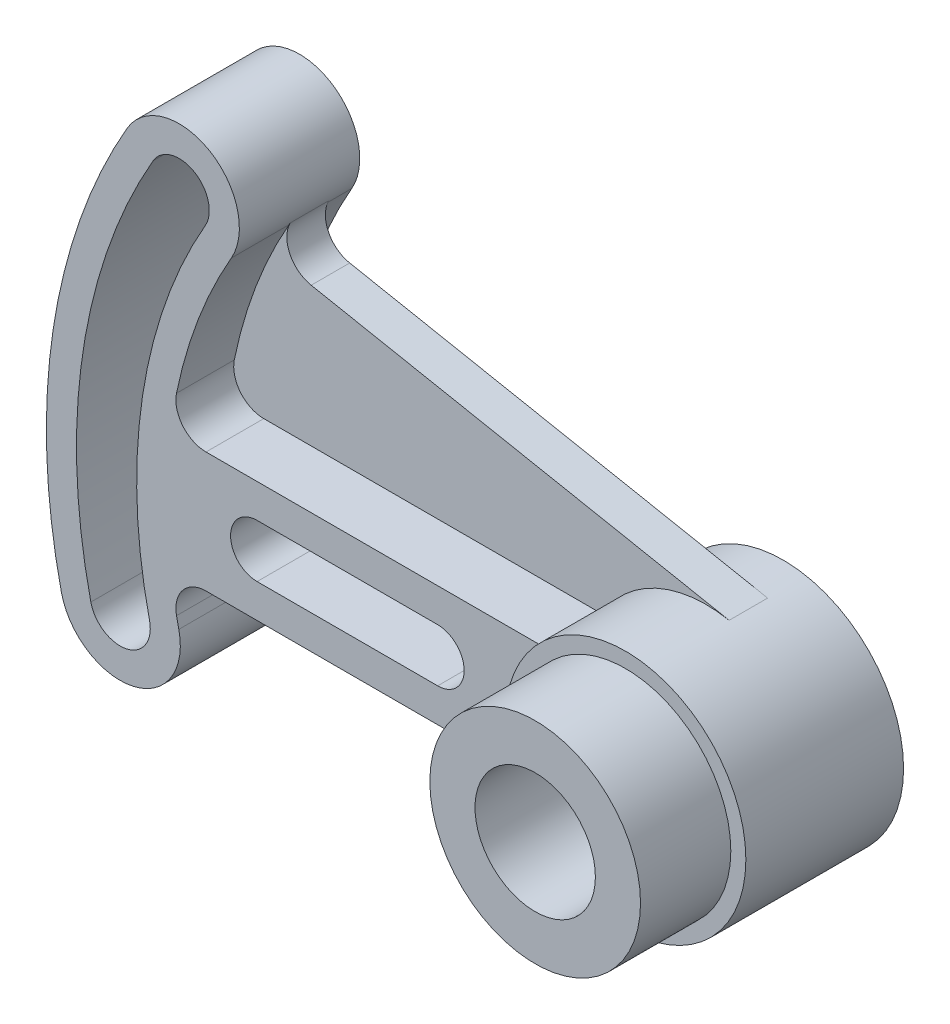
ISO-10303-21;
HEADER;
FILE_DESCRIPTION(('STEP AP214'),'2;1');
FILE_NAME('part.step','',(''),(''),'','','');
FILE_SCHEMA(('AUTOMOTIVE_DESIGN { 1 0 10303 214 1 1 1 1 }'));
ENDSEC;
DATA;
#1=APPLICATION_CONTEXT('core data for automotive mechanical design processes');
#2=APPLICATION_PROTOCOL_DEFINITION('international standard','automotive_design',2000,#1);
#3=PRODUCT_CONTEXT('',#1,'mechanical');
#4=PRODUCT('Part','Part','',(#3));
#5=PRODUCT_RELATED_PRODUCT_CATEGORY('part','',(#4));
#6=PRODUCT_DEFINITION_FORMATION('','',#4);
#7=PRODUCT_DEFINITION_CONTEXT('part definition',#1,'design');
#8=PRODUCT_DEFINITION('design','',#6,#7);
#9=PRODUCT_DEFINITION_SHAPE('','',#8);
#10=(LENGTH_UNIT() NAMED_UNIT(*) SI_UNIT(.MILLI.,.METRE.));
#11=(NAMED_UNIT(*) PLANE_ANGLE_UNIT() SI_UNIT($,.RADIAN.));
#12=(NAMED_UNIT(*) SI_UNIT($,.STERADIAN.) SOLID_ANGLE_UNIT());
#13=UNCERTAINTY_MEASURE_WITH_UNIT(LENGTH_MEASURE(1.E-05),#10,'distance_accuracy_value','');
#14=(GEOMETRIC_REPRESENTATION_CONTEXT(3) GLOBAL_UNCERTAINTY_ASSIGNED_CONTEXT((#13)) GLOBAL_UNIT_ASSIGNED_CONTEXT((#10,
#11,#12)) REPRESENTATION_CONTEXT('',''));
#15=CARTESIAN_POINT('',(0.,0.,0.));
#16=DIRECTION('',(0.,0.,1.));
#17=DIRECTION('',(1.,0.,0.));
#18=AXIS2_PLACEMENT_3D('',#15,#16,#17);
#19=CARTESIAN_POINT('',(1.98651322254819E-13,0.,28.448));
#20=DIRECTION('',(0.,0.,-1.));
#21=DIRECTION('',(-1.,0.,0.));
#22=AXIS2_PLACEMENT_3D('',#19,#20,#21);
#23=CYLINDRICAL_SURFACE('',#22,101.6);
#24=DIRECTION('',(0.,0.,-1.));
#25=VECTOR('',#24,1.);
#26=CARTESIAN_POINT('',(-87.9881810244987,50.8000000000002,28.4480000000006));
#27=LINE('',#26,#25);
#28=CARTESIAN_POINT('',(-87.9881810244988,50.8000000000002,8.128));
#29=VERTEX_POINT('',#28);
#30=CARTESIAN_POINT('',(-87.9881810244989,50.8000000000002,3.04800000000061));
#31=VERTEX_POINT('',#30);
#32=EDGE_CURVE('E228',#29,#31,#27,.T.);
#33=ORIENTED_EDGE('',*,*,#32,.F.);
#34=CARTESIAN_POINT('',(1.98651322254819E-13,0.,8.128));
#35=DIRECTION('',(0.,0.,1.));
#36=DIRECTION('',(1.,0.,0.));
#37=AXIS2_PLACEMENT_3D('',#34,#35,#36);
#38=CIRCLE('',#37,101.6);
#39=CARTESIAN_POINT('',(-99.5472631467082,20.32,8.128));
#40=VERTEX_POINT('',#39);
#41=EDGE_CURVE('E227',#29,#40,#38,.T.);
#42=ORIENTED_EDGE('',*,*,#41,.T.);
#43=DIRECTION('',(0.,0.,-1.));
#44=VECTOR('',#43,1.);
#45=CARTESIAN_POINT('',(-99.5472631467082,20.32,28.4480000000007));
#46=LINE('',#45,#44);
#47=CARTESIAN_POINT('',(-99.5472631467083,20.32,3.0480000000007));
#48=VERTEX_POINT('',#47);
#49=EDGE_CURVE('E211',#40,#48,#46,.T.);
#50=ORIENTED_EDGE('',*,*,#49,.T.);
#51=CARTESIAN_POINT('',(0.,0.,3.048));
#52=DIRECTION('',(0.,0.,-1.));
#53=DIRECTION('',(-1.,0.,0.));
#54=AXIS2_PLACEMENT_3D('',#51,#52,#53);
#55=CIRCLE('',#54,101.6);
#56=EDGE_CURVE('E392',#31,#48,#55,.F.);
#57=ORIENTED_EDGE('',*,*,#56,.F.);
#58=EDGE_LOOP('',(#33,#42,#50,#57));
#59=FACE_BOUND('',#58,.T.);
#60=ADVANCED_FACE('F43',(#59),#23,.F.);
#61=CARTESIAN_POINT('',(1.98648344738265E-13,12.7,28.448));
#62=DIRECTION('',(0.,-1.,0.));
#63=DIRECTION('',(0.,0.,-1.));
#64=AXIS2_PLACEMENT_3D('',#61,#62,#63);
#65=PLANE('',#64);
#66=DIRECTION('',(-1.,0.,0.));
#67=VECTOR('',#66,1.);
#68=CARTESIAN_POINT('',(0.,12.7,8.128));
#69=LINE('',#68,#67);
#70=CARTESIAN_POINT('',(-21.9970452561247,12.7,8.128));
#71=VERTEX_POINT('',#70);
#72=CARTESIAN_POINT('',(-93.325559200039,12.7,8.128));
#73=VERTEX_POINT('',#72);
#74=EDGE_CURVE('E238',#71,#73,#69,.T.);
#75=ORIENTED_EDGE('',*,*,#74,.F.);
#76=DIRECTION('',(0.,0.,-1.));
#77=VECTOR('',#76,1.);
#78=CARTESIAN_POINT('',(-21.9970452561245,12.7,28.4480000000002));
#79=LINE('',#78,#77);
#80=CARTESIAN_POINT('',(-21.9970452561247,12.7,3.04800000000015));
#81=VERTEX_POINT('',#80);
#82=EDGE_CURVE('E411',#71,#81,#79,.T.);
#83=ORIENTED_EDGE('',*,*,#82,.T.);
#84=DIRECTION('',(-1.,0.,0.));
#85=VECTOR('',#84,1.);
#86=CARTESIAN_POINT('',(0.,12.7,3.048));
#87=LINE('',#86,#85);
#88=CARTESIAN_POINT('',(-93.3255592000391,12.7,3.04800000000065));
#89=VERTEX_POINT('',#88);
#90=EDGE_CURVE('E395',#81,#89,#87,.T.);
#91=ORIENTED_EDGE('',*,*,#90,.T.);
#92=DIRECTION('',(0.,0.,-1.));
#93=VECTOR('',#92,1.);
#94=CARTESIAN_POINT('',(-93.3255592000389,12.7,28.4480000000007));
#95=LINE('',#94,#93);
#96=EDGE_CURVE('E449',#89,#73,#95,.F.);
#97=ORIENTED_EDGE('',*,*,#96,.T.);
#98=EDGE_LOOP('',(#75,#83,#91,#97));
#99=FACE_BOUND('',#98,.T.);
#100=ADVANCED_FACE('F558',(#99),#65,.F.);
#101=CARTESIAN_POINT('',(-93.3255592000389,19.05,28.4480000000007));
#102=DIRECTION('',(0.,0.,-1.));
#103=DIRECTION('',(-1.,0.,0.));
#104=AXIS2_PLACEMENT_3D('',#101,#102,#103);
#105=CYLINDRICAL_SURFACE('',#104,6.35);
#106=CARTESIAN_POINT('',(-93.3255592000389,19.05,8.128));
#107=DIRECTION('',(0.,0.,1.));
#108=DIRECTION('',(1.,0.,0.));
#109=AXIS2_PLACEMENT_3D('',#106,#107,#108);
#110=CIRCLE('',#109,6.35);
#111=EDGE_CURVE('E216',#40,#73,#110,.T.);
#112=ORIENTED_EDGE('',*,*,#111,.T.);
#113=ORIENTED_EDGE('',*,*,#96,.F.);
#114=CARTESIAN_POINT('',(-93.3255592000391,19.05,3.04800000000065));
#115=DIRECTION('',(0.,0.,-1.));
#116=DIRECTION('',(-1.,0.,0.));
#117=AXIS2_PLACEMENT_3D('',#114,#115,#116);
#118=CIRCLE('',#117,6.35);
#119=EDGE_CURVE('E218',#48,#89,#118,.F.);
#120=ORIENTED_EDGE('',*,*,#119,.F.);
#121=ORIENTED_EDGE('',*,*,#49,.F.);
#122=EDGE_LOOP('',(#112,#113,#120,#121));
#123=FACE_BOUND('',#122,.T.);
#124=ADVANCED_FACE('F213',(#123),#105,.F.);
#125=CARTESIAN_POINT('',(0.,0.,33.274));
#126=DIRECTION('',(0.,0.,-1.));
#127=DIRECTION('',(-1.,0.,0.));
#128=AXIS2_PLACEMENT_3D('',#125,#126,#127);
#129=CYLINDRICAL_SURFACE('',#128,25.4);
#130=CARTESIAN_POINT('',(0.,0.,0.));
#131=DIRECTION('',(0.,0.,1.));
#132=DIRECTION('',(1.,0.,0.));
#133=AXIS2_PLACEMENT_3D('',#130,#131,#132);
#134=CIRCLE('',#133,25.4);
#135=CARTESIAN_POINT('',(25.4,0.,0.));
#136=VERTEX_POINT('',#135);
#137=EDGE_CURVE('E436',#136,#136,#134,.T.);
#138=ORIENTED_EDGE('',*,*,#137,.T.);
#139=EDGE_LOOP('',(#138));
#140=FACE_BOUND('',#139,.T.);
#141=CARTESIAN_POINT('',(0.,0.,33.274));
#142=DIRECTION('',(0.,0.,1.));
#143=DIRECTION('',(1.,0.,0.));
#144=AXIS2_PLACEMENT_3D('',#141,#142,#143);
#145=CIRCLE('',#144,25.4);
#146=CARTESIAN_POINT('',(25.4,0.,33.274));
#147=VERTEX_POINT('',#146);
#148=EDGE_CURVE('E440',#147,#147,#145,.T.);
#149=ORIENTED_EDGE('',*,*,#148,.F.);
#150=EDGE_LOOP('',(#149));
#151=FACE_BOUND('',#150,.T.);
#152=DIRECTION('',(0.,0.,-1.));
#153=VECTOR('',#152,1.);
#154=CARTESIAN_POINT('',(4.8465484825639,24.9333304595708,16.256));
#155=LINE('',#154,#153);
#156=CARTESIAN_POINT('',(4.84654848256389,24.9333304595707,16.256));
#157=VERTEX_POINT('',#156);
#158=CARTESIAN_POINT('',(4.8465484825639,24.9333304595708,8.128));
#159=VERTEX_POINT('',#158);
#160=EDGE_CURVE('E249',#157,#159,#155,.T.);
#161=ORIENTED_EDGE('',*,*,#160,.F.);
#162=CARTESIAN_POINT('',(0.,0.,16.256));
#163=DIRECTION('',(0.,0.,1.));
#164=DIRECTION('',(1.,0.,0.));
#165=AXIS2_PLACEMENT_3D('',#162,#163,#164);
#166=CIRCLE('',#165,25.4);
#167=CARTESIAN_POINT('',(-21.9970452561246,12.7,16.256));
#168=VERTEX_POINT('',#167);
#169=EDGE_CURVE('E254',#157,#168,#166,.T.);
#170=ORIENTED_EDGE('',*,*,#169,.T.);
#171=CARTESIAN_POINT('',(-21.9970452561245,12.7,28.4480000000002));
#172=VERTEX_POINT('',#171);
#173=EDGE_CURVE('E407',#172,#168,#79,.T.);
#174=ORIENTED_EDGE('',*,*,#173,.F.);
#175=CARTESIAN_POINT('',(1.98651322254819E-13,0.,28.448));
#176=DIRECTION('',(0.,0.,-1.));
#177=DIRECTION('',(-1.,0.,0.));
#178=AXIS2_PLACEMENT_3D('',#175,#176,#177);
#179=CIRCLE('',#178,25.4);
#180=CARTESIAN_POINT('',(-21.9970452561245,-12.7,28.4480000000002));
#181=VERTEX_POINT('',#180);
#182=EDGE_CURVE('E370',#181,#172,#179,.T.);
#183=ORIENTED_EDGE('',*,*,#182,.F.);
#184=DIRECTION('',(0.,0.,-1.));
#185=VECTOR('',#184,1.);
#186=CARTESIAN_POINT('',(-21.9970452561245,-12.7,28.4480000000002));
#187=LINE('',#186,#185);
#188=CARTESIAN_POINT('',(-21.9970452561247,-12.7,3.04800000000015));
#189=VERTEX_POINT('',#188);
#190=EDGE_CURVE('E402',#181,#189,#187,.T.);
#191=ORIENTED_EDGE('',*,*,#190,.T.);
#192=CARTESIAN_POINT('',(0.,0.,3.048));
#193=DIRECTION('',(0.,0.,-1.));
#194=DIRECTION('',(-1.,0.,0.));
#195=AXIS2_PLACEMENT_3D('',#192,#193,#194);
#196=CIRCLE('',#195,25.4);
#197=EDGE_CURVE('E348',#189,#81,#196,.T.);
#198=ORIENTED_EDGE('',*,*,#197,.T.);
#199=ORIENTED_EDGE('',*,*,#82,.F.);
#200=CARTESIAN_POINT('',(0.,0.,8.128));
#201=DIRECTION('',(0.,0.,1.));
#202=DIRECTION('',(1.,0.,0.));
#203=AXIS2_PLACEMENT_3D('',#200,#201,#202);
#204=CIRCLE('',#203,25.4);
#205=EDGE_CURVE('E242',#159,#71,#204,.T.);
#206=ORIENTED_EDGE('',*,*,#205,.F.);
#207=EDGE_LOOP('',(#161,#170,#174,#183,#191,#198,#199,#206));
#208=FACE_BOUND('',#207,.T.);
#209=ADVANCED_FACE('F523',(#140,#151,#208),#129,.T.);
#210=CARTESIAN_POINT('',(0.,0.,33.274));
#211=DIRECTION('',(0.,0.,1.));
#212=DIRECTION('',(1.,0.,0.));
#213=AXIS2_PLACEMENT_3D('',#210,#211,#212);
#214=PLANE('',#213);
#215=CARTESIAN_POINT('',(0.,0.,33.274));
#216=DIRECTION('',(0.,0.,1.));
#217=DIRECTION('',(1.,0.,0.));
#218=AXIS2_PLACEMENT_3D('',#215,#216,#217);
#219=CIRCLE('',#218,22.225);
#220=CARTESIAN_POINT('',(-22.225,0.,33.274));
#221=VERTEX_POINT('',#220);
#222=EDGE_CURVE('E224',#221,#221,#219,.T.);
#223=ORIENTED_EDGE('',*,*,#222,.F.);
#224=EDGE_LOOP('',(#223));
#225=FACE_BOUND('',#224,.T.);
#226=ORIENTED_EDGE('',*,*,#148,.T.);
#227=EDGE_LOOP('',(#226));
#228=FACE_BOUND('',#227,.T.);
#229=ADVANCED_FACE('F595',(#225,#228),#214,.T.);
#230=CARTESIAN_POINT('',(0.,0.,0.));
#231=DIRECTION('',(0.,0.,1.));
#232=DIRECTION('',(1.,0.,0.));
#233=AXIS2_PLACEMENT_3D('',#230,#231,#232);
#234=PLANE('',#233);
#235=CARTESIAN_POINT('',(0.,0.,0.));
#236=DIRECTION('',(0.,0.,1.));
#237=DIRECTION('',(1.,0.,0.));
#238=AXIS2_PLACEMENT_3D('',#235,#236,#237);
#239=CIRCLE('',#238,12.7);
#240=CARTESIAN_POINT('',(12.7,0.,0.));
#241=VERTEX_POINT('',#240);
#242=EDGE_CURVE('E406',#241,#241,#239,.T.);
#243=ORIENTED_EDGE('',*,*,#242,.T.);
#244=EDGE_LOOP('',(#243));
#245=FACE_BOUND('',#244,.T.);
#246=ORIENTED_EDGE('',*,*,#137,.F.);
#247=EDGE_LOOP('',(#246));
#248=FACE_BOUND('',#247,.T.);
#249=ADVANCED_FACE('F593',(#245,#248),#234,.F.);
#250=CARTESIAN_POINT('',(0.,0.,52.324));
#251=DIRECTION('',(0.,0.,-1.));
#252=DIRECTION('',(-1.,0.,0.));
#253=AXIS2_PLACEMENT_3D('',#250,#251,#252);
#254=CYLINDRICAL_SURFACE('',#253,22.225);
#255=CARTESIAN_POINT('',(0.,0.,52.324));
#256=DIRECTION('',(0.,0.,1.));
#257=DIRECTION('',(1.,0.,0.));
#258=AXIS2_PLACEMENT_3D('',#255,#256,#257);
#259=CIRCLE('',#258,22.225);
#260=CARTESIAN_POINT('',(-22.225,0.,52.324));
#261=VERTEX_POINT('',#260);
#262=EDGE_CURVE('E429',#261,#261,#259,.T.);
#263=CARTESIAN_POINT('',(-22.225,0.,52.324));
#264=CARTESIAN_POINT('',(-22.225,0.,52.1255625));
#265=CARTESIAN_POINT('',(-22.225,0.,51.927125));
#266=CARTESIAN_POINT('',(-22.225,0.,51.53025));
#267=CARTESIAN_POINT('',(-22.225,0.,51.3318125));
#268=CARTESIAN_POINT('',(-22.225,0.,50.9349375));
#269=CARTESIAN_POINT('',(-22.225,0.,50.7365));
#270=CARTESIAN_POINT('',(-22.225,0.,50.339625));
#271=CARTESIAN_POINT('',(-22.225,0.,50.1411875));
#272=CARTESIAN_POINT('',(-22.225,0.,49.7443125));
#273=CARTESIAN_POINT('',(-22.225,0.,49.545875));
#274=CARTESIAN_POINT('',(-22.225,0.,49.149));
#275=CARTESIAN_POINT('',(-22.225,0.,48.9505625));
#276=CARTESIAN_POINT('',(-22.225,0.,48.5536875));
#277=CARTESIAN_POINT('',(-22.225,0.,48.35525));
#278=CARTESIAN_POINT('',(-22.225,0.,47.958375));
#279=CARTESIAN_POINT('',(-22.225,0.,47.7599375));
#280=CARTESIAN_POINT('',(-22.225,0.,47.3630625));
#281=CARTESIAN_POINT('',(-22.225,0.,47.164625));
#282=CARTESIAN_POINT('',(-22.225,0.,46.76775));
#283=CARTESIAN_POINT('',(-22.225,0.,46.5693125));
#284=CARTESIAN_POINT('',(-22.225,0.,46.1724375));
#285=CARTESIAN_POINT('',(-22.225,0.,45.974));
#286=CARTESIAN_POINT('',(-22.225,0.,45.577125));
#287=CARTESIAN_POINT('',(-22.225,0.,45.3786875));
#288=CARTESIAN_POINT('',(-22.225,0.,44.9818125));
#289=CARTESIAN_POINT('',(-22.225,0.,44.783375));
#290=CARTESIAN_POINT('',(-22.225,0.,44.3865));
#291=CARTESIAN_POINT('',(-22.225,0.,44.1880625));
#292=CARTESIAN_POINT('',(-22.225,0.,43.7911875));
#293=CARTESIAN_POINT('',(-22.225,0.,43.59275));
#294=CARTESIAN_POINT('',(-22.225,0.,43.195875));
#295=CARTESIAN_POINT('',(-22.225,0.,42.9974375));
#296=CARTESIAN_POINT('',(-22.225,0.,42.6005625));
#297=CARTESIAN_POINT('',(-22.225,0.,42.402125));
#298=CARTESIAN_POINT('',(-22.225,0.,42.00525));
#299=CARTESIAN_POINT('',(-22.225,0.,41.8068125));
#300=CARTESIAN_POINT('',(-22.225,0.,41.4099375));
#301=CARTESIAN_POINT('',(-22.225,0.,41.2115));
#302=CARTESIAN_POINT('',(-22.225,0.,40.814625));
#303=CARTESIAN_POINT('',(-22.225,0.,40.6161875));
#304=CARTESIAN_POINT('',(-22.225,0.,40.2193125));
#305=CARTESIAN_POINT('',(-22.225,0.,40.020875));
#306=CARTESIAN_POINT('',(-22.225,0.,39.624));
#307=CARTESIAN_POINT('',(-22.225,0.,39.4255625));
#308=CARTESIAN_POINT('',(-22.225,0.,39.0286875));
#309=CARTESIAN_POINT('',(-22.225,0.,38.83025));
#310=CARTESIAN_POINT('',(-22.225,0.,38.433375));
#311=CARTESIAN_POINT('',(-22.225,0.,38.2349375));
#312=CARTESIAN_POINT('',(-22.225,0.,37.8380625));
#313=CARTESIAN_POINT('',(-22.225,0.,37.639625));
#314=CARTESIAN_POINT('',(-22.225,0.,37.24275));
#315=CARTESIAN_POINT('',(-22.225,0.,37.0443125));
#316=CARTESIAN_POINT('',(-22.225,0.,36.6474375));
#317=CARTESIAN_POINT('',(-22.225,0.,36.449));
#318=CARTESIAN_POINT('',(-22.225,0.,36.052125));
#319=CARTESIAN_POINT('',(-22.225,0.,35.8536875));
#320=CARTESIAN_POINT('',(-22.225,0.,35.4568125));
#321=CARTESIAN_POINT('',(-22.225,0.,35.258375));
#322=CARTESIAN_POINT('',(-22.225,0.,34.8615));
#323=CARTESIAN_POINT('',(-22.225,0.,34.6630625));
#324=CARTESIAN_POINT('',(-22.225,0.,34.2661875));
#325=CARTESIAN_POINT('',(-22.225,0.,34.06775));
#326=CARTESIAN_POINT('',(-22.225,0.,33.670875));
#327=CARTESIAN_POINT('',(-22.225,0.,33.4724375));
#328=CARTESIAN_POINT('',(-22.225,0.,33.274));
#329=B_SPLINE_CURVE_WITH_KNOTS('',3,(#263,#264,#265,#266,#267,#268,#269,#270,#271,#272,#273,
#274,#275,#276,#277,#278,#279,#280,#281,#282,#283,#284,#285,#286,#287,#288,#289,#290,#291,#292,
#293,#294,#295,#296,#297,#298,#299,#300,#301,#302,#303,#304,#305,#306,#307,#308,#309,#310,#311,
#312,#313,#314,#315,#316,#317,#318,#319,#320,#321,#322,#323,#324,#325,#326,#327,#328),
.UNSPECIFIED.,.F.,.F.,(4,2,2,2,2,2,2,2,2,2,2,2,2,2,2,2,2,2,2,2,2,2,2,2,2,2,2,2,2,2,2,2,4),(0.,
0.5953125,1.190625,1.7859375,2.38125,2.9765625,3.571875,4.1671875,4.7625,5.3578125,5.953125,
6.5484375,7.14375,7.7390625,8.334375,8.92968750000001,9.52500000000001,10.1203125,10.715625,
11.3109375,11.90625,12.5015625,13.096875,13.6921875,14.2875,14.8828125,15.478125,16.0734375,
16.66875,17.2640625,17.859375,18.4546875,19.05),.UNSPECIFIED.);
#330=EDGE_CURVE('BSEAM589',#261,#221,#329,.T.);
#331=ORIENTED_EDGE('',*,*,#262,.F.);
#332=ORIENTED_EDGE('',*,*,#222,.T.);
#333=ORIENTED_EDGE('',*,*,#330,.T.);
#334=ORIENTED_EDGE('',*,*,#330,.F.);
#335=EDGE_LOOP('',(#331,#333,#332,#334));
#336=FACE_BOUND('',#335,.T.);
#337=ADVANCED_FACE('F589',(#336),#254,.T.);
#338=CARTESIAN_POINT('',(0.,0.,52.324));
#339=DIRECTION('',(0.,0.,1.));
#340=DIRECTION('',(1.,0.,0.));
#341=AXIS2_PLACEMENT_3D('',#338,#339,#340);
#342=PLANE('',#341);
#343=CARTESIAN_POINT('',(0.,0.,52.324));
#344=DIRECTION('',(0.,0.,1.));
#345=DIRECTION('',(1.,0.,0.));
#346=AXIS2_PLACEMENT_3D('',#343,#344,#345);
#347=CIRCLE('',#346,12.7);
#348=CARTESIAN_POINT('',(12.7,0.,52.324));
#349=VERTEX_POINT('',#348);
#350=EDGE_CURVE('E425',#349,#349,#347,.T.);
#351=ORIENTED_EDGE('',*,*,#350,.F.);
#352=EDGE_LOOP('',(#351));
#353=FACE_BOUND('',#352,.T.);
#354=ORIENTED_EDGE('',*,*,#262,.T.);
#355=EDGE_LOOP('',(#354));
#356=FACE_BOUND('',#355,.T.);
#357=ADVANCED_FACE('F581',(#353,#356),#342,.T.);
#358=CARTESIAN_POINT('',(0.,0.,52.324));
#359=DIRECTION('',(0.,0.,-1.));
#360=DIRECTION('',(-1.,0.,0.));
#361=AXIS2_PLACEMENT_3D('',#358,#359,#360);
#362=CYLINDRICAL_SURFACE('',#361,12.7);
#363=ORIENTED_EDGE('',*,*,#350,.T.);
#364=EDGE_LOOP('',(#363));
#365=FACE_BOUND('',#364,.T.);
#366=ORIENTED_EDGE('',*,*,#242,.F.);
#367=EDGE_LOOP('',(#366));
#368=FACE_BOUND('',#367,.T.);
#369=ADVANCED_FACE('F576',(#365,#368),#362,.F.);
#370=CARTESIAN_POINT('',(1.98648344738265E-13,-12.7,28.448));
#371=DIRECTION('',(0.,-1.,0.));
#372=DIRECTION('',(0.,0.,-1.));
#373=AXIS2_PLACEMENT_3D('',#370,#371,#372);
#374=PLANE('',#373);
#375=DIRECTION('',(-1.,0.,0.));
#376=VECTOR('',#375,1.);
#377=CARTESIAN_POINT('',(1.98648344738265E-13,-12.7,28.448));
#378=LINE('',#377,#376);
#379=CARTESIAN_POINT('',(-93.3255592000389,-12.7,28.4480000000007));
#380=VERTEX_POINT('',#379);
#381=EDGE_CURVE('E343',#181,#380,#378,.T.);
#382=ORIENTED_EDGE('',*,*,#381,.T.);
#383=DIRECTION('',(0.,0.,1.));
#384=VECTOR('',#383,1.);
#385=CARTESIAN_POINT('',(-93.3255592000391,-12.7,3.04800000000065));
#386=LINE('',#385,#384);
#387=CARTESIAN_POINT('',(-93.3255592000391,-12.7,3.04800000000065));
#388=VERTEX_POINT('',#387);
#389=EDGE_CURVE('E457',#380,#388,#386,.F.);
#390=ORIENTED_EDGE('',*,*,#389,.T.);
#391=DIRECTION('',(-1.,0.,0.));
#392=VECTOR('',#391,1.);
#393=CARTESIAN_POINT('',(0.,-12.7,3.048));
#394=LINE('',#393,#392);
#395=EDGE_CURVE('E342',#189,#388,#394,.T.);
#396=ORIENTED_EDGE('',*,*,#395,.F.);
#397=ORIENTED_EDGE('',*,*,#190,.F.);
#398=EDGE_LOOP('',(#382,#390,#396,#397));
#399=FACE_BOUND('',#398,.T.);
#400=ADVANCED_FACE('F553',(#399),#374,.T.);
#401=ORIENTED_EDGE('',*,*,#173,.T.);
#402=DIRECTION('',(-1.,0.,0.));
#403=VECTOR('',#402,1.);
#404=CARTESIAN_POINT('',(0.,12.7,16.256));
#405=LINE('',#404,#403);
#406=CARTESIAN_POINT('',(-93.325559200039,12.7,16.256));
#407=VERTEX_POINT('',#406);
#408=EDGE_CURVE('E514',#168,#407,#405,.T.);
#409=ORIENTED_EDGE('',*,*,#408,.T.);
#410=CARTESIAN_POINT('',(-93.3255592000389,12.7,28.4480000000007));
#411=VERTEX_POINT('',#410);
#412=EDGE_CURVE('E448',#407,#411,#95,.F.);
#413=ORIENTED_EDGE('',*,*,#412,.T.);
#414=DIRECTION('',(-1.,0.,0.));
#415=VECTOR('',#414,1.);
#416=CARTESIAN_POINT('',(1.98648344738265E-13,12.7,28.448));
#417=LINE('',#416,#415);
#418=EDGE_CURVE('E366',#172,#411,#417,.T.);
#419=ORIENTED_EDGE('',*,*,#418,.F.);
#420=EDGE_LOOP('',(#401,#409,#413,#419));
#421=FACE_BOUND('',#420,.T.);
#422=ADVANCED_FACE('F526',(#421),#65,.F.);
#423=CARTESIAN_POINT('',(1.98651322254819E-13,0.,16.256));
#424=DIRECTION('',(0.,0.,1.));
#425=DIRECTION('',(1.,0.,0.));
#426=AXIS2_PLACEMENT_3D('',#423,#424,#425);
#427=CIRCLE('',#426,101.6);
#428=CARTESIAN_POINT('',(-87.9881810244988,50.8000000000002,16.256));
#429=VERTEX_POINT('',#428);
#430=CARTESIAN_POINT('',(-99.5472631467082,20.32,16.256));
#431=VERTEX_POINT('',#430);
#432=EDGE_CURVE('E59',#429,#431,#427,.T.);
#433=ORIENTED_EDGE('',*,*,#432,.F.);
#434=CARTESIAN_POINT('',(-87.9881810244987,50.8000000000002,28.4480000000006));
#435=VERTEX_POINT('',#434);
#436=EDGE_CURVE('E412',#435,#429,#27,.T.);
#437=ORIENTED_EDGE('',*,*,#436,.F.);
#438=CARTESIAN_POINT('',(1.98651322254819E-13,0.,28.448));
#439=DIRECTION('',(0.,0.,-1.));
#440=DIRECTION('',(-1.,0.,0.));
#441=AXIS2_PLACEMENT_3D('',#438,#439,#440);
#442=CIRCLE('',#441,101.6);
#443=CARTESIAN_POINT('',(-99.5472631467082,20.32,28.4480000000007));
#444=VERTEX_POINT('',#443);
#445=EDGE_CURVE('E362',#435,#444,#442,.F.);
#446=ORIENTED_EDGE('',*,*,#445,.T.);
#447=EDGE_CURVE('E223',#444,#431,#46,.T.);
#448=ORIENTED_EDGE('',*,*,#447,.T.);
#449=EDGE_LOOP('',(#433,#437,#446,#448));
#450=FACE_BOUND('',#449,.T.);
#451=ADVANCED_FACE('F497',(#450),#23,.F.);
#452=CARTESIAN_POINT('',(-98.9867036525611,57.1500000000002,28.4480000000007));
#453=DIRECTION('',(0.,0.,-1.));
#454=DIRECTION('',(-1.,0.,0.));
#455=AXIS2_PLACEMENT_3D('',#452,#453,#454);
#456=CYLINDRICAL_SURFACE('',#455,12.7);
#457=DIRECTION('',(0.,0.,-1.));
#458=VECTOR('',#457,1.);
#459=CARTESIAN_POINT('',(-87.7383967013521,51.2537646984383,28.4480000000006));
#460=LINE('',#459,#458);
#461=CARTESIAN_POINT('',(-87.7383967013522,51.2537646984383,16.256));
#462=VERTEX_POINT('',#461);
#463=CARTESIAN_POINT('',(-87.7383967013522,51.2537646984383,8.128));
#464=VERTEX_POINT('',#463);
#465=EDGE_CURVE('E474',#462,#464,#460,.T.);
#466=ORIENTED_EDGE('',*,*,#465,.T.);
#467=CARTESIAN_POINT('',(-98.9867036525612,57.1500000000002,8.128));
#468=DIRECTION('',(0.,0.,1.));
#469=DIRECTION('',(1.,0.,0.));
#470=AXIS2_PLACEMENT_3D('',#467,#468,#469);
#471=CIRCLE('',#470,12.7);
#472=EDGE_CURVE('E478',#464,#29,#471,.F.);
#473=ORIENTED_EDGE('',*,*,#472,.T.);
#474=ORIENTED_EDGE('',*,*,#32,.T.);
#475=CARTESIAN_POINT('',(-98.9867036525612,57.1500000000002,3.04800000000069));
#476=DIRECTION('',(0.,0.,-1.));
#477=DIRECTION('',(-1.,0.,0.));
#478=AXIS2_PLACEMENT_3D('',#475,#476,#477);
#479=CIRCLE('',#478,12.7);
#480=CARTESIAN_POINT('',(-109.985226280624,63.5000000000002,3.04800000000077));
#481=VERTEX_POINT('',#480);
#482=EDGE_CURVE('E388',#481,#31,#479,.T.);
#483=ORIENTED_EDGE('',*,*,#482,.F.);
#484=DIRECTION('',(0.,0.,-1.));
#485=VECTOR('',#484,1.);
#486=CARTESIAN_POINT('',(-109.985226280623,63.5000000000002,28.4480000000008));
#487=LINE('',#486,#485);
#488=CARTESIAN_POINT('',(-109.985226280623,63.5000000000002,28.4480000000008));
#489=VERTEX_POINT('',#488);
#490=EDGE_CURVE('E416',#489,#481,#487,.T.);
#491=ORIENTED_EDGE('',*,*,#490,.F.);
#492=CARTESIAN_POINT('',(-98.9867036525611,57.1500000000002,28.4480000000007));
#493=DIRECTION('',(0.,0.,-1.));
#494=DIRECTION('',(-1.,0.,0.));
#495=AXIS2_PLACEMENT_3D('',#492,#493,#494);
#496=CIRCLE('',#495,12.7);
#497=EDGE_CURVE('E358',#489,#435,#496,.T.);
#498=ORIENTED_EDGE('',*,*,#497,.T.);
#499=ORIENTED_EDGE('',*,*,#436,.T.);
#500=CARTESIAN_POINT('',(-98.9867036525611,57.1500000000002,16.256));
#501=DIRECTION('',(0.,0.,1.));
#502=DIRECTION('',(1.,0.,0.));
#503=AXIS2_PLACEMENT_3D('',#500,#501,#502);
#504=CIRCLE('',#503,12.7);
#505=EDGE_CURVE('E470',#429,#462,#504,.T.);
#506=ORIENTED_EDGE('',*,*,#505,.T.);
#507=EDGE_LOOP('',(#466,#473,#474,#483,#491,#498,#499,#506));
#508=FACE_BOUND('',#507,.T.);
#509=ADVANCED_FACE('F494',(#508),#456,.T.);
#510=CARTESIAN_POINT('',(1.98651322254819E-13,0.,28.448));
#511=DIRECTION('',(0.,0.,-1.));
#512=DIRECTION('',(-1.,0.,0.));
#513=AXIS2_PLACEMENT_3D('',#510,#511,#512);
#514=CYLINDRICAL_SURFACE('',#513,127.);
#515=CARTESIAN_POINT('',(0.,0.,3.048));
#516=DIRECTION('',(0.,0.,-1.));
#517=DIRECTION('',(-1.,0.,0.));
#518=AXIS2_PLACEMENT_3D('',#515,#516,#517);
#519=CIRCLE('',#518,127.);
#520=CARTESIAN_POINT('',(-123.824497466533,-28.2222222222222,3.04800000000086));
#521=VERTEX_POINT('',#520);
#522=EDGE_CURVE('E384',#481,#521,#519,.F.);
#523=ORIENTED_EDGE('',*,*,#522,.T.);
#524=DIRECTION('',(0.,0.,-1.));
#525=VECTOR('',#524,1.);
#526=CARTESIAN_POINT('',(-123.824497466533,-28.2222222222222,28.4480000000009));
#527=LINE('',#526,#525);
#528=CARTESIAN_POINT('',(-123.824497466533,-28.2222222222222,28.4480000000009));
#529=VERTEX_POINT('',#528);
#530=EDGE_CURVE('E419',#529,#521,#527,.T.);
#531=ORIENTED_EDGE('',*,*,#530,.F.);
#532=CARTESIAN_POINT('',(1.98651322254819E-13,0.,28.448));
#533=DIRECTION('',(0.,0.,-1.));
#534=DIRECTION('',(-1.,0.,0.));
#535=AXIS2_PLACEMENT_3D('',#532,#533,#534);
#536=CIRCLE('',#535,127.);
#537=EDGE_CURVE('E355',#489,#529,#536,.F.);
#538=ORIENTED_EDGE('',*,*,#537,.F.);
#539=ORIENTED_EDGE('',*,*,#490,.T.);
#540=EDGE_LOOP('',(#523,#531,#538,#539));
#541=FACE_BOUND('',#540,.T.);
#542=ADVANCED_FACE('F537',(#541),#514,.T.);
#543=CARTESIAN_POINT('',(-111.44204771988,-25.4,28.4480000000008));
#544=DIRECTION('',(0.,0.,-1.));
#545=DIRECTION('',(-1.,0.,0.));
#546=AXIS2_PLACEMENT_3D('',#543,#544,#545);
#547=CYLINDRICAL_SURFACE('',#546,12.7);
#548=CARTESIAN_POINT('',(-111.44204771988,-25.4,3.04800000000078));
#549=DIRECTION('',(0.,0.,-1.));
#550=DIRECTION('',(-1.,0.,0.));
#551=AXIS2_PLACEMENT_3D('',#548,#549,#550);
#552=CIRCLE('',#551,12.7);
#553=CARTESIAN_POINT('',(-99.0595979732266,-22.5777777777778,3.04800000000069));
#554=VERTEX_POINT('',#553);
#555=EDGE_CURVE('E380',#554,#521,#552,.T.);
#556=ORIENTED_EDGE('',*,*,#555,.F.);
#557=DIRECTION('',(0.,0.,-1.));
#558=VECTOR('',#557,1.);
#559=CARTESIAN_POINT('',(-99.0595979732265,-22.5777777777778,28.4480000000007));
#560=LINE('',#559,#558);
#561=CARTESIAN_POINT('',(-99.0595979732265,-22.5777777777778,28.4480000000007));
#562=VERTEX_POINT('',#561);
#563=EDGE_CURVE('E373',#562,#554,#560,.T.);
#564=ORIENTED_EDGE('',*,*,#563,.F.);
#565=CARTESIAN_POINT('',(-111.44204771988,-25.4,28.4480000000008));
#566=DIRECTION('',(0.,0.,-1.));
#567=DIRECTION('',(-1.,0.,0.));
#568=AXIS2_PLACEMENT_3D('',#565,#566,#567);
#569=CIRCLE('',#568,12.7);
#570=EDGE_CURVE('E351',#562,#529,#569,.T.);
#571=ORIENTED_EDGE('',*,*,#570,.T.);
#572=ORIENTED_EDGE('',*,*,#530,.T.);
#573=EDGE_LOOP('',(#556,#564,#571,#572));
#574=FACE_BOUND('',#573,.T.);
#575=ADVANCED_FACE('F544',(#574),#547,.T.);
#576=CARTESIAN_POINT('',(1.98651322254819E-13,0.,28.448));
#577=DIRECTION('',(0.,0.,-1.));
#578=DIRECTION('',(-1.,0.,0.));
#579=AXIS2_PLACEMENT_3D('',#576,#577,#578);
#580=CYLINDRICAL_SURFACE('',#579,101.6);
#581=CARTESIAN_POINT('',(0.,0.,3.048));
#582=DIRECTION('',(0.,0.,-1.));
#583=DIRECTION('',(-1.,0.,0.));
#584=AXIS2_PLACEMENT_3D('',#581,#582,#583);
#585=CIRCLE('',#584,101.6);
#586=CARTESIAN_POINT('',(-99.5472631467083,-20.32,3.0480000000007));
#587=VERTEX_POINT('',#586);
#588=EDGE_CURVE('E377',#587,#554,#585,.F.);
#589=ORIENTED_EDGE('',*,*,#588,.F.);
#590=DIRECTION('',(0.,0.,-1.));
#591=VECTOR('',#590,1.);
#592=CARTESIAN_POINT('',(-99.5472631467082,-20.32,28.4480000000007));
#593=LINE('',#592,#591);
#594=CARTESIAN_POINT('',(-99.5472631467082,-20.32,28.4480000000007));
#595=VERTEX_POINT('',#594);
#596=EDGE_CURVE('E461',#587,#595,#593,.F.);
#597=ORIENTED_EDGE('',*,*,#596,.T.);
#598=CARTESIAN_POINT('',(1.98651322254819E-13,0.,28.448));
#599=DIRECTION('',(0.,0.,-1.));
#600=DIRECTION('',(-1.,0.,0.));
#601=AXIS2_PLACEMENT_3D('',#598,#599,#600);
#602=CIRCLE('',#601,101.6);
#603=EDGE_CURVE('E347',#595,#562,#602,.F.);
#604=ORIENTED_EDGE('',*,*,#603,.T.);
#605=ORIENTED_EDGE('',*,*,#563,.T.);
#606=EDGE_LOOP('',(#589,#597,#604,#605));
#607=FACE_BOUND('',#606,.T.);
#608=ADVANCED_FACE('F547',(#607),#580,.F.);
#609=CARTESIAN_POINT('',(1.98648344738265E-13,0.,28.448));
#610=DIRECTION('',(0.,0.,-1.));
#611=DIRECTION('',(-1.,0.,0.));
#612=AXIS2_PLACEMENT_3D('',#609,#610,#611);
#613=PLANE('',#612);
#614=CARTESIAN_POINT('',(-44.4499999999998,0.,28.4480000000003));
#615=DIRECTION('',(0.,0.,-1.));
#616=DIRECTION('',(-1.,0.,0.));
#617=AXIS2_PLACEMENT_3D('',#614,#615,#616);
#618=CIRCLE('',#617,5.588);
#619=CARTESIAN_POINT('',(-44.4499999999998,5.588,28.4480000000004));
#620=VERTEX_POINT('',#619);
#621=CARTESIAN_POINT('',(-44.4499999999998,-5.588,28.4480000000003));
#622=VERTEX_POINT('',#621);
#623=EDGE_CURVE('E334',#620,#622,#618,.T.);
#624=ORIENTED_EDGE('',*,*,#623,.T.);
#625=DIRECTION('',(-1.,0.,0.));
#626=VECTOR('',#625,1.);
#627=CARTESIAN_POINT('',(1.98648344738265E-13,-5.588,28.448));
#628=LINE('',#627,#626);
#629=CARTESIAN_POINT('',(-82.5499999999998,-5.588,28.4480000000006));
#630=VERTEX_POINT('',#629);
#631=EDGE_CURVE('E338',#622,#630,#628,.T.);
#632=ORIENTED_EDGE('',*,*,#631,.T.);
#633=CARTESIAN_POINT('',(-82.5499999999998,0.,28.4480000000006));
#634=DIRECTION('',(0.,0.,-1.));
#635=DIRECTION('',(-1.,0.,0.));
#636=AXIS2_PLACEMENT_3D('',#633,#634,#635);
#637=CIRCLE('',#636,5.588);
#638=CARTESIAN_POINT('',(-82.5499999999998,5.588,28.4480000000006));
#639=VERTEX_POINT('',#638);
#640=EDGE_CURVE('E326',#630,#639,#637,.T.);
#641=ORIENTED_EDGE('',*,*,#640,.T.);
#642=DIRECTION('',(-1.,0.,0.));
#643=VECTOR('',#642,1.);
#644=CARTESIAN_POINT('',(1.98648344738265E-13,5.588,28.448));
#645=LINE('',#644,#643);
#646=EDGE_CURVE('E330',#620,#639,#645,.T.);
#647=ORIENTED_EDGE('',*,*,#646,.F.);
#648=EDGE_LOOP('',(#624,#632,#641,#647));
#649=FACE_BOUND('',#648,.T.);
#650=CARTESIAN_POINT('',(-111.429773542551,-25.4537928068845,28.4480000000008));
#651=DIRECTION('',(0.,0.,-1.));
#652=DIRECTION('',(-1.,0.,0.));
#653=AXIS2_PLACEMENT_3D('',#650,#651,#652);
#654=CIRCLE('',#653,6.34999999999999);
#655=CARTESIAN_POINT('',(-105.239230567965,-24.0396932065021,28.4480000000008));
#656=VERTEX_POINT('',#655);
#657=CARTESIAN_POINT('',(-117.620316517137,-26.867892407267,28.4480000000008));
#658=VERTEX_POINT('',#657);
#659=EDGE_CURVE('E318',#656,#658,#654,.T.);
#660=ORIENTED_EDGE('',*,*,#659,.T.);
#661=CARTESIAN_POINT('',(1.98651322254819E-13,0.,28.448));
#662=DIRECTION('',(0.,0.,-1.));
#663=DIRECTION('',(-1.,0.,0.));
#664=AXIS2_PLACEMENT_3D('',#661,#662,#663);
#665=CIRCLE('',#664,120.65);
#666=CARTESIAN_POINT('',(-104.485964966592,60.3250000000001,28.4480000000007));
#667=VERTEX_POINT('',#666);
#668=EDGE_CURVE('E322',#658,#667,#665,.T.);
#669=ORIENTED_EDGE('',*,*,#668,.T.);
#670=CARTESIAN_POINT('',(-98.9867036525611,57.1500000000002,28.4480000000007));
#671=DIRECTION('',(0.,0.,-1.));
#672=DIRECTION('',(-1.,0.,0.));
#673=AXIS2_PLACEMENT_3D('',#670,#671,#672);
#674=CIRCLE('',#673,6.34999999999999);
#675=CARTESIAN_POINT('',(-93.4874423385299,53.9750000000001,28.4480000000007));
#676=VERTEX_POINT('',#675);
#677=EDGE_CURVE('E275',#667,#676,#674,.T.);
#678=ORIENTED_EDGE('',*,*,#677,.T.);
#679=CARTESIAN_POINT('',(1.98651322254819E-13,0.,28.448));
#680=DIRECTION('',(0.,0.,-1.));
#681=DIRECTION('',(-1.,0.,0.));
#682=AXIS2_PLACEMENT_3D('',#679,#680,#681);
#683=CIRCLE('',#682,107.95);
#684=EDGE_CURVE('E314',#656,#676,#683,.T.);
#685=ORIENTED_EDGE('',*,*,#684,.F.);
#686=EDGE_LOOP('',(#660,#669,#678,#685));
#687=FACE_BOUND('',#686,.T.);
#688=ORIENTED_EDGE('',*,*,#381,.F.);
#689=ORIENTED_EDGE('',*,*,#182,.T.);
#690=ORIENTED_EDGE('',*,*,#418,.T.);
#691=CARTESIAN_POINT('',(-93.3255592000389,19.05,28.4480000000007));
#692=DIRECTION('',(0.,0.,-1.));
#693=DIRECTION('',(-1.,0.,0.));
#694=AXIS2_PLACEMENT_3D('',#691,#692,#693);
#695=CIRCLE('',#694,6.35);
#696=EDGE_CURVE('E454',#411,#444,#695,.T.);
#697=ORIENTED_EDGE('',*,*,#696,.T.);
#698=ORIENTED_EDGE('',*,*,#445,.F.);
#699=ORIENTED_EDGE('',*,*,#497,.F.);
#700=ORIENTED_EDGE('',*,*,#537,.T.);
#701=ORIENTED_EDGE('',*,*,#570,.F.);
#702=ORIENTED_EDGE('',*,*,#603,.F.);
#703=CARTESIAN_POINT('',(-93.3255592000389,-19.05,28.4480000000007));
#704=DIRECTION('',(0.,0.,-1.));
#705=DIRECTION('',(-1.,0.,0.));
#706=AXIS2_PLACEMENT_3D('',#703,#704,#705);
#707=CIRCLE('',#706,6.35);
#708=EDGE_CURVE('E467',#595,#380,#707,.T.);
#709=ORIENTED_EDGE('',*,*,#708,.T.);
#710=EDGE_LOOP('',(#688,#689,#690,#697,#698,#699,#700,#701,#702,#709));
#711=FACE_BOUND('',#710,.T.);
#712=ADVANCED_FACE('F501',(#649,#687,#711),#613,.F.);
#713=CARTESIAN_POINT('',(0.,0.,3.048));
#714=DIRECTION('',(0.,0.,-1.));
#715=DIRECTION('',(-1.,0.,0.));
#716=AXIS2_PLACEMENT_3D('',#713,#714,#715);
#717=PLANE('',#716);
#718=DIRECTION('',(-1.,0.,0.));
#719=VECTOR('',#718,1.);
#720=CARTESIAN_POINT('',(0.,-5.588,3.048));
#721=LINE('',#720,#719);
#722=CARTESIAN_POINT('',(-44.45,-5.588,3.04800000000031));
#723=VERTEX_POINT('',#722);
#724=CARTESIAN_POINT('',(-82.55,-5.588,3.04800000000058));
#725=VERTEX_POINT('',#724);
#726=EDGE_CURVE('E255',#723,#725,#721,.T.);
#727=ORIENTED_EDGE('',*,*,#726,.F.);
#728=CARTESIAN_POINT('',(-44.45,0.,3.04800000000031));
#729=DIRECTION('',(0.,0.,-1.));
#730=DIRECTION('',(-1.,0.,0.));
#731=AXIS2_PLACEMENT_3D('',#728,#729,#730);
#732=CIRCLE('',#731,5.588);
#733=CARTESIAN_POINT('',(-44.45,5.588,3.04800000000031));
#734=VERTEX_POINT('',#733);
#735=EDGE_CURVE('E267',#734,#723,#732,.T.);
#736=ORIENTED_EDGE('',*,*,#735,.F.);
#737=DIRECTION('',(-1.,0.,0.));
#738=VECTOR('',#737,1.);
#739=CARTESIAN_POINT('',(0.,5.588,3.048));
#740=LINE('',#739,#738);
#741=CARTESIAN_POINT('',(-82.55,5.588,3.04800000000058));
#742=VERTEX_POINT('',#741);
#743=EDGE_CURVE('E263',#734,#742,#740,.T.);
#744=ORIENTED_EDGE('',*,*,#743,.T.);
#745=CARTESIAN_POINT('',(-82.55,0.,3.04800000000058));
#746=DIRECTION('',(0.,0.,-1.));
#747=DIRECTION('',(-1.,0.,0.));
#748=AXIS2_PLACEMENT_3D('',#745,#746,#747);
#749=CIRCLE('',#748,5.588);
#750=EDGE_CURVE('E258',#725,#742,#749,.T.);
#751=ORIENTED_EDGE('',*,*,#750,.F.);
#752=EDGE_LOOP('',(#727,#736,#744,#751));
#753=FACE_BOUND('',#752,.T.);
#754=CARTESIAN_POINT('',(0.,0.,3.048));
#755=DIRECTION('',(0.,0.,-1.));
#756=DIRECTION('',(-1.,0.,0.));
#757=AXIS2_PLACEMENT_3D('',#754,#755,#756);
#758=CIRCLE('',#757,120.65);
#759=CARTESIAN_POINT('',(-117.620316517137,-26.867892407267,3.04800000000082));
#760=VERTEX_POINT('',#759);
#761=CARTESIAN_POINT('',(-104.485964966592,60.3250000000001,3.04800000000073));
#762=VERTEX_POINT('',#761);
#763=EDGE_CURVE('E253',#760,#762,#758,.T.);
#764=ORIENTED_EDGE('',*,*,#763,.F.);
#765=CARTESIAN_POINT('',(-111.429773542551,-25.4537928068845,3.04800000000078));
#766=DIRECTION('',(0.,0.,-1.));
#767=DIRECTION('',(-1.,0.,0.));
#768=AXIS2_PLACEMENT_3D('',#765,#766,#767);
#769=CIRCLE('',#768,6.34999999999999);
#770=CARTESIAN_POINT('',(-105.239230567965,-24.0396932065021,3.04800000000073));
#771=VERTEX_POINT('',#770);
#772=EDGE_CURVE('E295',#771,#760,#769,.T.);
#773=ORIENTED_EDGE('',*,*,#772,.F.);
#774=CARTESIAN_POINT('',(0.,0.,3.048));
#775=DIRECTION('',(0.,0.,-1.));
#776=DIRECTION('',(-1.,0.,0.));
#777=AXIS2_PLACEMENT_3D('',#774,#775,#776);
#778=CIRCLE('',#777,107.95);
#779=CARTESIAN_POINT('',(-93.4874423385301,53.9750000000001,3.04800000000065));
#780=VERTEX_POINT('',#779);
#781=EDGE_CURVE('E291',#771,#780,#778,.T.);
#782=ORIENTED_EDGE('',*,*,#781,.T.);
#783=CARTESIAN_POINT('',(-98.9867036525612,57.1500000000002,3.04800000000069));
#784=DIRECTION('',(0.,0.,-1.));
#785=DIRECTION('',(-1.,0.,0.));
#786=AXIS2_PLACEMENT_3D('',#783,#784,#785);
#787=CIRCLE('',#786,6.34999999999999);
#788=EDGE_CURVE('E287',#762,#780,#787,.T.);
#789=ORIENTED_EDGE('',*,*,#788,.F.);
#790=EDGE_LOOP('',(#764,#773,#782,#789));
#791=FACE_BOUND('',#790,.T.);
#792=ORIENTED_EDGE('',*,*,#395,.T.);
#793=CARTESIAN_POINT('',(-93.3255592000391,-19.05,3.04800000000065));
#794=DIRECTION('',(0.,0.,-1.));
#795=DIRECTION('',(-1.,0.,0.));
#796=AXIS2_PLACEMENT_3D('',#793,#794,#795);
#797=CIRCLE('',#796,6.35);
#798=EDGE_CURVE('E464',#388,#587,#797,.F.);
#799=ORIENTED_EDGE('',*,*,#798,.T.);
#800=ORIENTED_EDGE('',*,*,#588,.T.);
#801=ORIENTED_EDGE('',*,*,#555,.T.);
#802=ORIENTED_EDGE('',*,*,#522,.F.);
#803=ORIENTED_EDGE('',*,*,#482,.T.);
#804=ORIENTED_EDGE('',*,*,#56,.T.);
#805=ORIENTED_EDGE('',*,*,#119,.T.);
#806=ORIENTED_EDGE('',*,*,#90,.F.);
#807=ORIENTED_EDGE('',*,*,#197,.F.);
#808=EDGE_LOOP('',(#792,#799,#800,#801,#802,#803,#804,#805,#806,#807));
#809=FACE_BOUND('',#808,.T.);
#810=ADVANCED_FACE('F533',(#753,#791,#809),#717,.T.);
#811=ORIENTED_EDGE('',*,*,#412,.F.);
#812=CARTESIAN_POINT('',(-93.3255592000389,19.05,16.256));
#813=DIRECTION('',(0.,0.,1.));
#814=DIRECTION('',(1.,0.,0.));
#815=AXIS2_PLACEMENT_3D('',#812,#813,#814);
#816=CIRCLE('',#815,6.35);
#817=EDGE_CURVE('E508',#431,#407,#816,.T.);
#818=ORIENTED_EDGE('',*,*,#817,.F.);
#819=ORIENTED_EDGE('',*,*,#447,.F.);
#820=ORIENTED_EDGE('',*,*,#696,.F.);
#821=EDGE_LOOP('',(#811,#818,#819,#820));
#822=FACE_BOUND('',#821,.T.);
#823=ADVANCED_FACE('F506',(#822),#105,.F.);
#824=CARTESIAN_POINT('',(-93.3255592000389,-19.05,28.4480000000007));
#825=DIRECTION('',(0.,0.,-1.));
#826=DIRECTION('',(-1.,0.,0.));
#827=AXIS2_PLACEMENT_3D('',#824,#825,#826);
#828=CYLINDRICAL_SURFACE('',#827,6.35);
#829=ORIENTED_EDGE('',*,*,#708,.F.);
#830=ORIENTED_EDGE('',*,*,#596,.F.);
#831=ORIENTED_EDGE('',*,*,#798,.F.);
#832=ORIENTED_EDGE('',*,*,#389,.F.);
#833=EDGE_LOOP('',(#829,#830,#831,#832));
#834=FACE_BOUND('',#833,.T.);
#835=ADVANCED_FACE('F550',(#834),#828,.F.);
#836=CARTESIAN_POINT('',(3.65376539147257E-13,0.,52.3240000000002));
#837=DIRECTION('',(0.,0.,-1.));
#838=DIRECTION('',(-1.,0.,0.));
#839=AXIS2_PLACEMENT_3D('',#836,#837,#838);
#840=CYLINDRICAL_SURFACE('',#839,120.65);
#841=DIRECTION('',(0.,0.,-1.));
#842=VECTOR('',#841,1.);
#843=CARTESIAN_POINT('',(-117.620316517137,-26.867892407267,52.324000000001));
#844=LINE('',#843,#842);
#845=EDGE_CURVE('E259',#658,#760,#844,.T.);
#846=ORIENTED_EDGE('',*,*,#845,.T.);
#847=ORIENTED_EDGE('',*,*,#763,.T.);
#848=DIRECTION('',(0.,0.,-1.));
#849=VECTOR('',#848,1.);
#850=CARTESIAN_POINT('',(-104.485964966592,60.3250000000001,52.3240000000009));
#851=LINE('',#850,#849);
#852=EDGE_CURVE('E299',#667,#762,#851,.T.);
#853=ORIENTED_EDGE('',*,*,#852,.F.);
#854=ORIENTED_EDGE('',*,*,#668,.F.);
#855=EDGE_LOOP('',(#846,#847,#853,#854));
#856=FACE_BOUND('',#855,.T.);
#857=ADVANCED_FACE('F604',(#856),#840,.F.);
#858=CARTESIAN_POINT('',(-111.429773542551,-25.4537928068845,52.324000000001));
#859=DIRECTION('',(0.,0.,-1.));
#860=DIRECTION('',(-1.,0.,0.));
#861=AXIS2_PLACEMENT_3D('',#858,#859,#860);
#862=CYLINDRICAL_SURFACE('',#861,6.34999999999999);
#863=DIRECTION('',(0.,0.,-1.));
#864=VECTOR('',#863,1.);
#865=CARTESIAN_POINT('',(-105.239230567964,-24.0396932065021,52.3240000000009));
#866=LINE('',#865,#864);
#867=EDGE_CURVE('E302',#656,#771,#866,.T.);
#868=ORIENTED_EDGE('',*,*,#867,.T.);
#869=ORIENTED_EDGE('',*,*,#772,.T.);
#870=ORIENTED_EDGE('',*,*,#845,.F.);
#871=ORIENTED_EDGE('',*,*,#659,.F.);
#872=EDGE_LOOP('',(#868,#869,#870,#871));
#873=FACE_BOUND('',#872,.T.);
#874=ADVANCED_FACE('F609',(#873),#862,.F.);
#875=CARTESIAN_POINT('',(3.65376539147257E-13,0.,52.3240000000002));
#876=DIRECTION('',(0.,0.,-1.));
#877=DIRECTION('',(-1.,0.,0.));
#878=AXIS2_PLACEMENT_3D('',#875,#876,#877);
#879=CYLINDRICAL_SURFACE('',#878,107.95);
#880=ORIENTED_EDGE('',*,*,#684,.T.);
#881=DIRECTION('',(0.,0.,-1.));
#882=VECTOR('',#881,1.);
#883=CARTESIAN_POINT('',(-93.4874423385297,53.9750000000001,52.3240000000008));
#884=LINE('',#883,#882);
#885=EDGE_CURVE('E305',#676,#780,#884,.T.);
#886=ORIENTED_EDGE('',*,*,#885,.T.);
#887=ORIENTED_EDGE('',*,*,#781,.F.);
#888=ORIENTED_EDGE('',*,*,#867,.F.);
#889=EDGE_LOOP('',(#880,#886,#887,#888));
#890=FACE_BOUND('',#889,.T.);
#891=ADVANCED_FACE('F615',(#890),#879,.T.);
#892=CARTESIAN_POINT('',(-98.9867036525609,57.1500000000002,52.3240000000009));
#893=DIRECTION('',(0.,0.,-1.));
#894=DIRECTION('',(-1.,0.,0.));
#895=AXIS2_PLACEMENT_3D('',#892,#893,#894);
#896=CYLINDRICAL_SURFACE('',#895,6.34999999999999);
#897=ORIENTED_EDGE('',*,*,#852,.T.);
#898=ORIENTED_EDGE('',*,*,#788,.T.);
#899=ORIENTED_EDGE('',*,*,#885,.F.);
#900=ORIENTED_EDGE('',*,*,#677,.F.);
#901=EDGE_LOOP('',(#897,#898,#899,#900));
#902=FACE_BOUND('',#901,.T.);
#903=ADVANCED_FACE('F620',(#902),#896,.F.);
#904=CARTESIAN_POINT('',(3.65372924619481E-13,-5.588,52.3240000000002));
#905=DIRECTION('',(0.,-1.,0.));
#906=DIRECTION('',(0.,0.,-1.));
#907=AXIS2_PLACEMENT_3D('',#904,#905,#906);
#908=PLANE('',#907);
#909=DIRECTION('',(0.,0.,-1.));
#910=VECTOR('',#909,1.);
#911=CARTESIAN_POINT('',(-44.4499999999996,-5.588,52.3240000000005));
#912=LINE('',#911,#910);
#913=EDGE_CURVE('E272',#622,#723,#912,.T.);
#914=ORIENTED_EDGE('',*,*,#913,.T.);
#915=ORIENTED_EDGE('',*,*,#726,.T.);
#916=DIRECTION('',(0.,0.,-1.));
#917=VECTOR('',#916,1.);
#918=CARTESIAN_POINT('',(-82.5499999999996,-5.588,52.3240000000008));
#919=LINE('',#918,#917);
#920=EDGE_CURVE('E271',#630,#725,#919,.T.);
#921=ORIENTED_EDGE('',*,*,#920,.F.);
#922=ORIENTED_EDGE('',*,*,#631,.F.);
#923=EDGE_LOOP('',(#914,#915,#921,#922));
#924=FACE_BOUND('',#923,.T.);
#925=ADVANCED_FACE('F647',(#924),#908,.F.);
#926=CARTESIAN_POINT('',(-44.4499999999996,0.,52.3240000000005));
#927=DIRECTION('',(0.,0.,-1.));
#928=DIRECTION('',(-1.,0.,0.));
#929=AXIS2_PLACEMENT_3D('',#926,#927,#928);
#930=CYLINDRICAL_SURFACE('',#929,5.588);
#931=DIRECTION('',(0.,0.,-1.));
#932=VECTOR('',#931,1.);
#933=CARTESIAN_POINT('',(-44.4499999999996,5.588,52.3240000000005));
#934=LINE('',#933,#932);
#935=EDGE_CURVE('E276',#620,#734,#934,.T.);
#936=ORIENTED_EDGE('',*,*,#935,.T.);
#937=ORIENTED_EDGE('',*,*,#735,.T.);
#938=ORIENTED_EDGE('',*,*,#913,.F.);
#939=ORIENTED_EDGE('',*,*,#623,.F.);
#940=EDGE_LOOP('',(#936,#937,#938,#939));
#941=FACE_BOUND('',#940,.T.);
#942=ADVANCED_FACE('F651',(#941),#930,.F.);
#943=CARTESIAN_POINT('',(3.65372924619481E-13,5.588,52.3240000000002));
#944=DIRECTION('',(0.,-1.,0.));
#945=DIRECTION('',(0.,0.,-1.));
#946=AXIS2_PLACEMENT_3D('',#943,#944,#945);
#947=PLANE('',#946);
#948=ORIENTED_EDGE('',*,*,#646,.T.);
#949=DIRECTION('',(0.,0.,-1.));
#950=VECTOR('',#949,1.);
#951=CARTESIAN_POINT('',(-82.5499999999996,5.588,52.3240000000008));
#952=LINE('',#951,#950);
#953=EDGE_CURVE('E279',#639,#742,#952,.T.);
#954=ORIENTED_EDGE('',*,*,#953,.T.);
#955=ORIENTED_EDGE('',*,*,#743,.F.);
#956=ORIENTED_EDGE('',*,*,#935,.F.);
#957=EDGE_LOOP('',(#948,#954,#955,#956));
#958=FACE_BOUND('',#957,.T.);
#959=ADVANCED_FACE('F656',(#958),#947,.T.);
#960=CARTESIAN_POINT('',(-82.5499999999996,0.,52.3240000000008));
#961=DIRECTION('',(0.,0.,-1.));
#962=DIRECTION('',(-1.,0.,0.));
#963=AXIS2_PLACEMENT_3D('',#960,#961,#962);
#964=CYLINDRICAL_SURFACE('',#963,5.588);
#965=ORIENTED_EDGE('',*,*,#920,.T.);
#966=ORIENTED_EDGE('',*,*,#750,.T.);
#967=ORIENTED_EDGE('',*,*,#953,.F.);
#968=ORIENTED_EDGE('',*,*,#640,.F.);
#969=EDGE_LOOP('',(#965,#966,#967,#968));
#970=FACE_BOUND('',#969,.T.);
#971=ADVANCED_FACE('F653',(#970),#964,.F.);
#972=CARTESIAN_POINT('',(4.8465484825639,24.9333304595708,16.256));
#973=DIRECTION('',(0.190808995376531,0.981627183447667,0.));
#974=DIRECTION('',(-0.981627183447667,0.190808995376531,0.));
#975=AXIS2_PLACEMENT_3D('',#972,#973,#974);
#976=PLANE('',#975);
#977=DIRECTION('',(0.981627183447667,-0.190808995376531,0.));
#978=VECTOR('',#977,1.);
#979=CARTESIAN_POINT('',(4.8465484825639,24.9333304595708,8.128));
#980=LINE('',#979,#978);
#981=CARTESIAN_POINT('',(-83.3258803463887,42.0723144327648,8.128));
#982=VERTEX_POINT('',#981);
#983=EDGE_CURVE('E233',#982,#159,#980,.T.);
#984=ORIENTED_EDGE('',*,*,#983,.F.);
#985=DIRECTION('',(0.,0.,1.));
#986=VECTOR('',#985,1.);
#987=CARTESIAN_POINT('',(-83.3258803463887,42.0723144327648,16.2559999999999));
#988=LINE('',#987,#986);
#989=CARTESIAN_POINT('',(-83.3258803463887,42.0723144327648,16.256));
#990=VERTEX_POINT('',#989);
#991=EDGE_CURVE('E67',#982,#990,#988,.T.);
#992=ORIENTED_EDGE('',*,*,#991,.T.);
#993=DIRECTION('',(0.981627183447667,-0.190808995376531,0.));
#994=VECTOR('',#993,1.);
#995=CARTESIAN_POINT('',(4.8465484825639,24.9333304595708,16.256));
#996=LINE('',#995,#994);
#997=EDGE_CURVE('E248',#990,#157,#996,.T.);
#998=ORIENTED_EDGE('',*,*,#997,.T.);
#999=ORIENTED_EDGE('',*,*,#160,.T.);
#1000=EDGE_LOOP('',(#984,#992,#998,#999));
#1001=FACE_BOUND('',#1000,.T.);
#1002=ADVANCED_FACE('F486',(#1001),#976,.T.);
#1003=CARTESIAN_POINT('',(0.,0.,16.256));
#1004=DIRECTION('',(0.,0.,1.));
#1005=DIRECTION('',(1.,0.,0.));
#1006=AXIS2_PLACEMENT_3D('',#1003,#1004,#1005);
#1007=PLANE('',#1006);
#1008=ORIENTED_EDGE('',*,*,#997,.F.);
#1009=CARTESIAN_POINT('',(-82.1142432257477,48.3056470476574,16.256));
#1010=DIRECTION('',(0.,0.,1.));
#1011=DIRECTION('',(1.,0.,0.));
#1012=AXIS2_PLACEMENT_3D('',#1009,#1010,#1011);
#1013=CIRCLE('',#1012,6.35);
#1014=EDGE_CURVE('E11',#990,#462,#1013,.F.);
#1015=ORIENTED_EDGE('',*,*,#1014,.T.);
#1016=ORIENTED_EDGE('',*,*,#505,.F.);
#1017=ORIENTED_EDGE('',*,*,#432,.T.);
#1018=ORIENTED_EDGE('',*,*,#817,.T.);
#1019=ORIENTED_EDGE('',*,*,#408,.F.);
#1020=ORIENTED_EDGE('',*,*,#169,.F.);
#1021=EDGE_LOOP('',(#1008,#1015,#1016,#1017,#1018,#1019,#1020));
#1022=FACE_BOUND('',#1021,.T.);
#1023=ADVANCED_FACE('F491',(#1022),#1007,.T.);
#1024=CARTESIAN_POINT('',(0.,0.,8.128));
#1025=DIRECTION('',(0.,0.,1.));
#1026=DIRECTION('',(1.,0.,0.));
#1027=AXIS2_PLACEMENT_3D('',#1024,#1025,#1026);
#1028=PLANE('',#1027);
#1029=ORIENTED_EDGE('',*,*,#41,.F.);
#1030=ORIENTED_EDGE('',*,*,#472,.F.);
#1031=CARTESIAN_POINT('',(-82.1142432257477,48.3056470476574,8.128));
#1032=DIRECTION('',(0.,0.,1.));
#1033=DIRECTION('',(1.,0.,0.));
#1034=AXIS2_PLACEMENT_3D('',#1031,#1032,#1033);
#1035=CIRCLE('',#1034,6.35);
#1036=EDGE_CURVE('E52',#464,#982,#1035,.T.);
#1037=ORIENTED_EDGE('',*,*,#1036,.T.);
#1038=ORIENTED_EDGE('',*,*,#983,.T.);
#1039=ORIENTED_EDGE('',*,*,#205,.T.);
#1040=ORIENTED_EDGE('',*,*,#74,.T.);
#1041=ORIENTED_EDGE('',*,*,#111,.F.);
#1042=EDGE_LOOP('',(#1029,#1030,#1037,#1038,#1039,#1040,#1041));
#1043=FACE_BOUND('',#1042,.T.);
#1044=ADVANCED_FACE('F236',(#1043),#1028,.F.);
#1045=CARTESIAN_POINT('',(-82.1142432257476,48.3056470476574,28.4480000000006));
#1046=DIRECTION('',(0.,0.,-1.));
#1047=DIRECTION('',(-1.,0.,0.));
#1048=AXIS2_PLACEMENT_3D('',#1045,#1046,#1047);
#1049=CYLINDRICAL_SURFACE('',#1048,6.35);
#1050=ORIENTED_EDGE('',*,*,#1014,.F.);
#1051=ORIENTED_EDGE('',*,*,#991,.F.);
#1052=ORIENTED_EDGE('',*,*,#1036,.F.);
#1053=ORIENTED_EDGE('',*,*,#465,.F.);
#1054=EDGE_LOOP('',(#1050,#1051,#1052,#1053));
#1055=FACE_BOUND('',#1054,.T.);
#1056=ADVANCED_FACE('F45',(#1055),#1049,.F.);
#1057=CLOSED_SHELL('',(#60,#100,#124,#209,#229,#249,#337,#357,#369,#400,#422,#451,#509,#542,
#575,#608,#712,#810,#823,#835,#857,#874,#891,#903,#925,#942,#959,#971,#1002,#1023,#1044,#1056));
#1058=MANIFOLD_SOLID_BREP('B2',#1057);
#1059=ADVANCED_BREP_SHAPE_REPRESENTATION('',(#18,#1058),#14);
#1060=SHAPE_DEFINITION_REPRESENTATION(#9,#1059);
ENDSEC;
END-ISO-10303-21;
